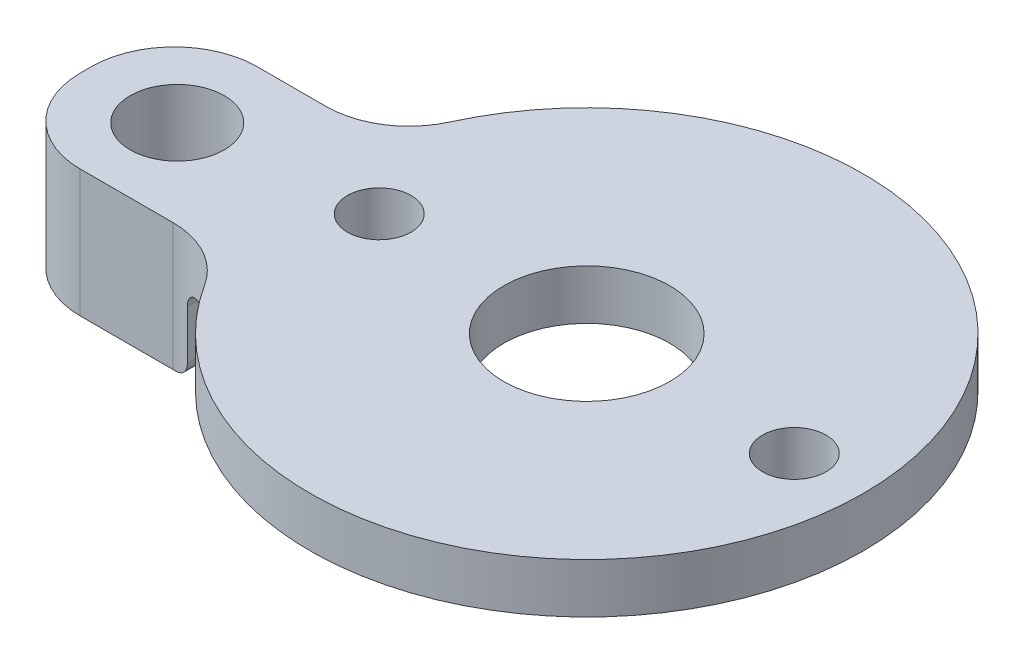
ISO-10303-21;
HEADER;
FILE_DESCRIPTION(('STEP AP214'),'2;1');
FILE_NAME('part.step','',(''),(''),'','','');
FILE_SCHEMA(('AUTOMOTIVE_DESIGN { 1 0 10303 214 1 1 1 1 }'));
ENDSEC;
DATA;
#1=APPLICATION_CONTEXT('core data for automotive mechanical design processes');
#2=APPLICATION_PROTOCOL_DEFINITION('international standard','automotive_design',2000,#1);
#3=PRODUCT_CONTEXT('',#1,'mechanical');
#4=PRODUCT('Part','Part','',(#3));
#5=PRODUCT_RELATED_PRODUCT_CATEGORY('part','',(#4));
#6=PRODUCT_DEFINITION_FORMATION('','',#4);
#7=PRODUCT_DEFINITION_CONTEXT('part definition',#1,'design');
#8=PRODUCT_DEFINITION('design','',#6,#7);
#9=PRODUCT_DEFINITION_SHAPE('','',#8);
#10=(LENGTH_UNIT() NAMED_UNIT(*) SI_UNIT(.MILLI.,.METRE.));
#11=(NAMED_UNIT(*) PLANE_ANGLE_UNIT() SI_UNIT($,.RADIAN.));
#12=(NAMED_UNIT(*) SI_UNIT($,.STERADIAN.) SOLID_ANGLE_UNIT());
#13=UNCERTAINTY_MEASURE_WITH_UNIT(LENGTH_MEASURE(1.E-05),#10,'distance_accuracy_value','');
#14=(GEOMETRIC_REPRESENTATION_CONTEXT(3) GLOBAL_UNCERTAINTY_ASSIGNED_CONTEXT((#13)) GLOBAL_UNIT_ASSIGNED_CONTEXT((#10,
#11,#12)) REPRESENTATION_CONTEXT('',''));
#15=CARTESIAN_POINT('',(0.,0.,0.));
#16=DIRECTION('',(0.,0.,1.));
#17=DIRECTION('',(1.,0.,0.));
#18=AXIS2_PLACEMENT_3D('',#15,#16,#17);
#19=CARTESIAN_POINT('',(0.,0.,0.));
#20=DIRECTION('',(0.,1.,0.));
#21=DIRECTION('',(0.,0.,1.));
#22=AXIS2_PLACEMENT_3D('',#19,#20,#21);
#23=PLANE('',#22);
#24=CARTESIAN_POINT('',(-9.525,0.,0.));
#25=DIRECTION('',(0.,1.,0.));
#26=DIRECTION('',(0.,0.,1.));
#27=AXIS2_PLACEMENT_3D('',#24,#25,#26);
#28=CIRCLE('',#27,1.4605);
#29=CARTESIAN_POINT('',(-9.525,0.,1.4605));
#30=VERTEX_POINT('',#29);
#31=EDGE_CURVE('E287',#30,#30,#28,.T.);
#32=ORIENTED_EDGE('',*,*,#31,.T.);
#33=EDGE_LOOP('',(#32));
#34=FACE_BOUND('',#33,.T.);
#35=CARTESIAN_POINT('',(9.525,0.,0.));
#36=DIRECTION('',(0.,1.,0.));
#37=DIRECTION('',(0.,0.,1.));
#38=AXIS2_PLACEMENT_3D('',#35,#36,#37);
#39=CIRCLE('',#38,1.4605);
#40=CARTESIAN_POINT('',(9.525,0.,1.4605));
#41=VERTEX_POINT('',#40);
#42=EDGE_CURVE('E281',#41,#41,#39,.T.);
#43=ORIENTED_EDGE('',*,*,#42,.T.);
#44=EDGE_LOOP('',(#43));
#45=FACE_BOUND('',#44,.T.);
#46=CARTESIAN_POINT('',(0.,0.,0.));
#47=DIRECTION('',(0.,1.,0.));
#48=DIRECTION('',(0.,0.,1.));
#49=AXIS2_PLACEMENT_3D('',#46,#47,#48);
#50=CIRCLE('',#49,3.81);
#51=CARTESIAN_POINT('',(0.,0.,3.81));
#52=VERTEX_POINT('',#51);
#53=EDGE_CURVE('E274',#52,#52,#50,.T.);
#54=ORIENTED_EDGE('',*,*,#53,.T.);
#55=EDGE_LOOP('',(#54));
#56=FACE_BOUND('',#55,.T.);
#57=CARTESIAN_POINT('',(-13.9121529606312,0.,8.89000000000004));
#58=DIRECTION('',(0.,1.,0.));
#59=DIRECTION('',(0.,0.,1.));
#60=AXIS2_PLACEMENT_3D('',#57,#58,#59);
#61=CIRCLE('',#60,3.81);
#62=CARTESIAN_POINT('',(-10.7016561235625,0.,6.83846153846157));
#63=VERTEX_POINT('',#62);
#64=CARTESIAN_POINT('',(-12.5473847014545,0.,5.33282308582446));
#65=VERTEX_POINT('',#64);
#66=EDGE_CURVE('E205',#63,#65,#61,.T.);
#67=ORIENTED_EDGE('',*,*,#66,.T.);
#68=DIRECTION('',(0.,0.,1.));
#69=VECTOR('',#68,1.);
#70=CARTESIAN_POINT('',(-12.5473847014545,0.,-3.51948445828535));
#71=LINE('',#70,#69);
#72=CARTESIAN_POINT('',(-12.5473847014545,0.,-3.95784349720127));
#73=VERTEX_POINT('',#72);
#74=EDGE_CURVE('E66',#65,#73,#71,.F.);
#75=ORIENTED_EDGE('',*,*,#74,.T.);
#76=CARTESIAN_POINT('',(-15.01825342708,0.,-6.85799999999996));
#77=DIRECTION('',(0.,1.,0.));
#78=DIRECTION('',(0.,0.,1.));
#79=AXIS2_PLACEMENT_3D('',#76,#77,#78);
#80=CIRCLE('',#79,3.81);
#81=CARTESIAN_POINT('',(-11.5525026362154,0.,-5.27538461538458));
#82=VERTEX_POINT('',#81);
#83=EDGE_CURVE('E201',#73,#82,#80,.T.);
#84=ORIENTED_EDGE('',*,*,#83,.T.);
#85=CARTESIAN_POINT('',(0.,0.,0.));
#86=DIRECTION('',(0.,1.,0.));
#87=DIRECTION('',(0.,0.,1.));
#88=AXIS2_PLACEMENT_3D('',#85,#86,#87);
#89=CIRCLE('',#88,12.7);
#90=EDGE_CURVE('E175',#63,#82,#89,.T.);
#91=ORIENTED_EDGE('',*,*,#90,.F.);
#92=EDGE_LOOP('',(#67,#75,#84,#91));
#93=FACE_BOUND('',#92,.T.);
#94=ADVANCED_FACE('F45',(#34,#45,#56,#93),#23,.F.);
#95=CARTESIAN_POINT('',(0.,2.286,0.));
#96=DIRECTION('',(0.,1.,0.));
#97=DIRECTION('',(0.,0.,1.));
#98=AXIS2_PLACEMENT_3D('',#95,#96,#97);
#99=PLANE('',#98);
#100=CARTESIAN_POINT('',(-9.525,2.286,0.));
#101=DIRECTION('',(0.,1.,0.));
#102=DIRECTION('',(0.,0.,1.));
#103=AXIS2_PLACEMENT_3D('',#100,#101,#102);
#104=CIRCLE('',#103,1.4605);
#105=CARTESIAN_POINT('',(-9.525,2.286,1.4605));
#106=VERTEX_POINT('',#105);
#107=EDGE_CURVE('E284',#106,#106,#104,.T.);
#108=ORIENTED_EDGE('',*,*,#107,.F.);
#109=EDGE_LOOP('',(#108));
#110=FACE_BOUND('',#109,.T.);
#111=CARTESIAN_POINT('',(0.,2.286,0.));
#112=DIRECTION('',(0.,1.,0.));
#113=DIRECTION('',(0.,0.,1.));
#114=AXIS2_PLACEMENT_3D('',#111,#112,#113);
#115=CIRCLE('',#114,3.81);
#116=CARTESIAN_POINT('',(0.,2.286,3.81));
#117=VERTEX_POINT('',#116);
#118=EDGE_CURVE('E277',#117,#117,#115,.T.);
#119=ORIENTED_EDGE('',*,*,#118,.F.);
#120=EDGE_LOOP('',(#119));
#121=FACE_BOUND('',#120,.T.);
#122=DIRECTION('',(0.,0.,1.));
#123=VECTOR('',#122,1.);
#124=CARTESIAN_POINT('',(-21.9808156771038,2.286,-3.04799999999995));
#125=LINE('',#124,#123);
#126=CARTESIAN_POINT('',(-21.9808156771038,2.286,0.762000000000044));
#127=VERTEX_POINT('',#126);
#128=CARTESIAN_POINT('',(-21.9808156771038,2.286,1.27000000000004));
#129=VERTEX_POINT('',#128);
#130=EDGE_CURVE('E172',#127,#129,#125,.T.);
#131=ORIENTED_EDGE('',*,*,#130,.T.);
#132=CARTESIAN_POINT('',(-18.1708156771038,2.286,1.27000000000004));
#133=DIRECTION('',(0.,1.,0.));
#134=DIRECTION('',(0.,0.,1.));
#135=AXIS2_PLACEMENT_3D('',#132,#133,#134);
#136=CIRCLE('',#135,3.81);
#137=CARTESIAN_POINT('',(-18.1708156771038,2.286,5.08000000000004));
#138=VERTEX_POINT('',#137);
#139=EDGE_CURVE('E182',#129,#138,#136,.T.);
#140=ORIENTED_EDGE('',*,*,#139,.T.);
#141=DIRECTION('',(1.,0.,0.));
#142=VECTOR('',#141,1.);
#143=CARTESIAN_POINT('',(-21.9808156771038,2.286,5.08000000000004));
#144=LINE('',#143,#142);
#145=CARTESIAN_POINT('',(-13.9121529606312,2.286,5.08000000000004));
#146=VERTEX_POINT('',#145);
#147=EDGE_CURVE('E169',#138,#146,#144,.T.);
#148=ORIENTED_EDGE('',*,*,#147,.T.);
#149=CARTESIAN_POINT('',(-13.9121529606312,2.286,8.89000000000004));
#150=DIRECTION('',(0.,1.,0.));
#151=DIRECTION('',(0.,0.,1.));
#152=AXIS2_PLACEMENT_3D('',#149,#150,#151);
#153=CIRCLE('',#152,3.81);
#154=CARTESIAN_POINT('',(-10.7016561235625,2.286,6.83846153846157));
#155=VERTEX_POINT('',#154);
#156=EDGE_CURVE('E211',#146,#155,#153,.F.);
#157=ORIENTED_EDGE('',*,*,#156,.T.);
#158=CARTESIAN_POINT('',(0.,2.286,0.));
#159=DIRECTION('',(0.,1.,0.));
#160=DIRECTION('',(0.,0.,1.));
#161=AXIS2_PLACEMENT_3D('',#158,#159,#160);
#162=CIRCLE('',#161,12.7);
#163=CARTESIAN_POINT('',(-11.5525026362154,2.286,-5.27538461538458));
#164=VERTEX_POINT('',#163);
#165=EDGE_CURVE('E267',#155,#164,#162,.T.);
#166=ORIENTED_EDGE('',*,*,#165,.T.);
#167=CARTESIAN_POINT('',(-15.01825342708,2.286,-6.85799999999996));
#168=DIRECTION('',(0.,1.,0.));
#169=DIRECTION('',(0.,0.,1.));
#170=AXIS2_PLACEMENT_3D('',#167,#168,#169);
#171=CIRCLE('',#170,3.81);
#172=CARTESIAN_POINT('',(-15.01825342708,2.286,-3.04799999999996));
#173=VERTEX_POINT('',#172);
#174=EDGE_CURVE('E203',#164,#173,#171,.F.);
#175=ORIENTED_EDGE('',*,*,#174,.T.);
#176=DIRECTION('',(-1.,0.,0.));
#177=VECTOR('',#176,1.);
#178=CARTESIAN_POINT('',(-12.3288156771038,2.286,-3.04799999999996));
#179=LINE('',#178,#177);
#180=CARTESIAN_POINT('',(-18.1708156771038,2.286,-3.04799999999996));
#181=VERTEX_POINT('',#180);
#182=EDGE_CURVE('E264',#173,#181,#179,.T.);
#183=ORIENTED_EDGE('',*,*,#182,.T.);
#184=CARTESIAN_POINT('',(-18.1708156771038,2.286,0.762000000000044));
#185=DIRECTION('',(0.,1.,0.));
#186=DIRECTION('',(0.,0.,1.));
#187=AXIS2_PLACEMENT_3D('',#184,#185,#186);
#188=CIRCLE('',#187,3.81);
#189=EDGE_CURVE('E180',#181,#127,#188,.T.);
#190=ORIENTED_EDGE('',*,*,#189,.T.);
#191=EDGE_LOOP('',(#131,#140,#148,#157,#166,#175,#183,#190));
#192=FACE_BOUND('',#191,.T.);
#193=CARTESIAN_POINT('',(9.525,2.286,0.));
#194=DIRECTION('',(0.,1.,0.));
#195=DIRECTION('',(0.,0.,1.));
#196=AXIS2_PLACEMENT_3D('',#193,#194,#195);
#197=CIRCLE('',#196,1.4605);
#198=CARTESIAN_POINT('',(9.525,2.286,1.4605));
#199=VERTEX_POINT('',#198);
#200=EDGE_CURVE('E278',#199,#199,#197,.T.);
#201=ORIENTED_EDGE('',*,*,#200,.F.);
#202=EDGE_LOOP('',(#201));
#203=FACE_BOUND('',#202,.T.);
#204=CARTESIAN_POINT('',(-17.7800000000002,2.286,1.01600000000016));
#205=DIRECTION('',(0.,1.,0.));
#206=DIRECTION('',(0.,0.,1.));
#207=AXIS2_PLACEMENT_3D('',#204,#205,#206);
#208=CIRCLE('',#207,2.159);
#209=CARTESIAN_POINT('',(-17.7800000000002,2.286,3.17500000000017));
#210=VERTEX_POINT('',#209);
#211=EDGE_CURVE('E153',#210,#210,#208,.T.);
#212=ORIENTED_EDGE('',*,*,#211,.F.);
#213=EDGE_LOOP('',(#212));
#214=FACE_BOUND('',#213,.T.);
#215=ADVANCED_FACE('F313',(#110,#121,#192,#203,#214),#99,.T.);
#216=CARTESIAN_POINT('',(0.,2.286,0.));
#217=DIRECTION('',(0.,-1.,0.));
#218=DIRECTION('',(0.,0.,-1.));
#219=AXIS2_PLACEMENT_3D('',#216,#217,#218);
#220=CYLINDRICAL_SURFACE('',#219,12.7);
#221=ORIENTED_EDGE('',*,*,#90,.T.);
#222=DIRECTION('',(0.,-1.,0.));
#223=VECTOR('',#222,1.);
#224=CARTESIAN_POINT('',(-11.5525026362154,2.286,-5.27538461538458));
#225=LINE('',#224,#223);
#226=EDGE_CURVE('E193',#82,#164,#225,.F.);
#227=ORIENTED_EDGE('',*,*,#226,.T.);
#228=ORIENTED_EDGE('',*,*,#165,.F.);
#229=DIRECTION('',(0.,-1.,0.));
#230=VECTOR('',#229,1.);
#231=CARTESIAN_POINT('',(-10.7016561235625,2.286,6.83846153846157));
#232=LINE('',#231,#230);
#233=EDGE_CURVE('E190',#155,#63,#232,.T.);
#234=ORIENTED_EDGE('',*,*,#233,.T.);
#235=EDGE_LOOP('',(#221,#227,#228,#234));
#236=FACE_BOUND('',#235,.T.);
#237=ADVANCED_FACE('F319',(#236),#220,.T.);
#238=CARTESIAN_POINT('',(-12.3288156771038,2.286,-3.04799999999996));
#239=DIRECTION('',(0.,0.,1.));
#240=DIRECTION('',(1.,0.,0.));
#241=AXIS2_PLACEMENT_3D('',#238,#239,#240);
#242=PLANE('',#241);
#243=ORIENTED_EDGE('',*,*,#182,.F.);
#244=DIRECTION('',(0.,1.,0.));
#245=VECTOR('',#244,1.);
#246=CARTESIAN_POINT('',(-15.01825342708,0.,-3.04799999999996));
#247=LINE('',#246,#245);
#248=CARTESIAN_POINT('',(-15.01825342708,-3.556,-3.04799999999996));
#249=VERTEX_POINT('',#248);
#250=EDGE_CURVE('E187',#173,#249,#247,.F.);
#251=ORIENTED_EDGE('',*,*,#250,.T.);
#252=DIRECTION('',(1.,0.,0.));
#253=VECTOR('',#252,1.);
#254=CARTESIAN_POINT('',(-21.9808156771038,-3.556,-3.04799999999996));
#255=LINE('',#254,#253);
#256=CARTESIAN_POINT('',(-18.1708156771038,-3.556,-3.04799999999996));
#257=VERTEX_POINT('',#256);
#258=EDGE_CURVE('E154',#257,#249,#255,.T.);
#259=ORIENTED_EDGE('',*,*,#258,.F.);
#260=DIRECTION('',(0.,-1.,0.));
#261=VECTOR('',#260,1.);
#262=CARTESIAN_POINT('',(-18.1708156771038,2.286,-3.04799999999996));
#263=LINE('',#262,#261);
#264=EDGE_CURVE('E184',#257,#181,#263,.F.);
#265=ORIENTED_EDGE('',*,*,#264,.T.);
#266=EDGE_LOOP('',(#243,#251,#259,#265));
#267=FACE_BOUND('',#266,.T.);
#268=ADVANCED_FACE('F262',(#267),#242,.F.);
#269=CARTESIAN_POINT('',(-21.9808156771038,2.286,-3.04799999999995));
#270=DIRECTION('',(1.,0.,0.));
#271=DIRECTION('',(0.,0.,-1.));
#272=AXIS2_PLACEMENT_3D('',#269,#270,#271);
#273=PLANE('',#272);
#274=DIRECTION('',(0.,0.,-1.));
#275=VECTOR('',#274,1.);
#276=CARTESIAN_POINT('',(-21.9808156771038,-3.556,5.08000000000004));
#277=LINE('',#276,#275);
#278=CARTESIAN_POINT('',(-21.9808156771038,-3.556,1.27000000000004));
#279=VERTEX_POINT('',#278);
#280=CARTESIAN_POINT('',(-21.9808156771038,-3.556,0.762000000000044));
#281=VERTEX_POINT('',#280);
#282=EDGE_CURVE('E295',#279,#281,#277,.T.);
#283=ORIENTED_EDGE('',*,*,#282,.F.);
#284=DIRECTION('',(0.,-1.,0.));
#285=VECTOR('',#284,1.);
#286=CARTESIAN_POINT('',(-21.9808156771038,2.286,1.27000000000004));
#287=LINE('',#286,#285);
#288=EDGE_CURVE('E162',#279,#129,#287,.F.);
#289=ORIENTED_EDGE('',*,*,#288,.T.);
#290=ORIENTED_EDGE('',*,*,#130,.F.);
#291=DIRECTION('',(0.,-1.,0.));
#292=VECTOR('',#291,1.);
#293=CARTESIAN_POINT('',(-21.9808156771038,2.286,0.762000000000044));
#294=LINE('',#293,#292);
#295=EDGE_CURVE('E163',#127,#281,#294,.T.);
#296=ORIENTED_EDGE('',*,*,#295,.T.);
#297=EDGE_LOOP('',(#283,#289,#290,#296));
#298=FACE_BOUND('',#297,.T.);
#299=ADVANCED_FACE('F328',(#298),#273,.F.);
#300=CARTESIAN_POINT('',(-21.9808156771038,2.286,5.08000000000004));
#301=DIRECTION('',(0.,0.,-1.));
#302=DIRECTION('',(-1.,0.,0.));
#303=AXIS2_PLACEMENT_3D('',#300,#301,#302);
#304=PLANE('',#303);
#305=DIRECTION('',(-1.,0.,0.));
#306=VECTOR('',#305,1.);
#307=CARTESIAN_POINT('',(-21.9808156771038,-3.556,5.08000000000004));
#308=LINE('',#307,#306);
#309=CARTESIAN_POINT('',(-13.9121529606312,-3.556,5.08000000000004));
#310=VERTEX_POINT('',#309);
#311=CARTESIAN_POINT('',(-18.1708156771038,-3.556,5.08000000000004));
#312=VERTEX_POINT('',#311);
#313=EDGE_CURVE('E139',#310,#312,#308,.T.);
#314=ORIENTED_EDGE('',*,*,#313,.F.);
#315=DIRECTION('',(0.,1.,0.));
#316=VECTOR('',#315,1.);
#317=CARTESIAN_POINT('',(-13.9121529606312,2.286,5.08000000000004));
#318=LINE('',#317,#316);
#319=EDGE_CURVE('E195',#310,#146,#318,.T.);
#320=ORIENTED_EDGE('',*,*,#319,.T.);
#321=ORIENTED_EDGE('',*,*,#147,.F.);
#322=DIRECTION('',(0.,-1.,0.));
#323=VECTOR('',#322,1.);
#324=CARTESIAN_POINT('',(-18.1708156771038,2.286,5.08000000000004));
#325=LINE('',#324,#323);
#326=EDGE_CURVE('E161',#138,#312,#325,.T.);
#327=ORIENTED_EDGE('',*,*,#326,.T.);
#328=EDGE_LOOP('',(#314,#320,#321,#327));
#329=FACE_BOUND('',#328,.T.);
#330=ADVANCED_FACE('F167',(#329),#304,.F.);
#331=CARTESIAN_POINT('',(0.,2.286,0.));
#332=DIRECTION('',(0.,-1.,0.));
#333=DIRECTION('',(0.,0.,-1.));
#334=AXIS2_PLACEMENT_3D('',#331,#332,#333);
#335=CYLINDRICAL_SURFACE('',#334,3.81);
#336=ORIENTED_EDGE('',*,*,#118,.T.);
#337=EDGE_LOOP('',(#336));
#338=FACE_BOUND('',#337,.T.);
#339=ORIENTED_EDGE('',*,*,#53,.F.);
#340=EDGE_LOOP('',(#339));
#341=FACE_BOUND('',#340,.T.);
#342=ADVANCED_FACE('F327',(#338,#341),#335,.F.);
#343=CARTESIAN_POINT('',(9.525,2.286,0.));
#344=DIRECTION('',(0.,-1.,0.));
#345=DIRECTION('',(0.,0.,-1.));
#346=AXIS2_PLACEMENT_3D('',#343,#344,#345);
#347=CYLINDRICAL_SURFACE('',#346,1.4605);
#348=ORIENTED_EDGE('',*,*,#200,.T.);
#349=EDGE_LOOP('',(#348));
#350=FACE_BOUND('',#349,.T.);
#351=ORIENTED_EDGE('',*,*,#42,.F.);
#352=EDGE_LOOP('',(#351));
#353=FACE_BOUND('',#352,.T.);
#354=ADVANCED_FACE('F405',(#350,#353),#347,.F.);
#355=CARTESIAN_POINT('',(-9.525,2.286,0.));
#356=DIRECTION('',(0.,-1.,0.));
#357=DIRECTION('',(0.,0.,-1.));
#358=AXIS2_PLACEMENT_3D('',#355,#356,#357);
#359=CYLINDRICAL_SURFACE('',#358,1.4605);
#360=ORIENTED_EDGE('',*,*,#107,.T.);
#361=EDGE_LOOP('',(#360));
#362=FACE_BOUND('',#361,.T.);
#363=ORIENTED_EDGE('',*,*,#31,.F.);
#364=EDGE_LOOP('',(#363));
#365=FACE_BOUND('',#364,.T.);
#366=ADVANCED_FACE('F309',(#362,#365),#359,.F.);
#367=CARTESIAN_POINT('',(-17.7800000000002,2.286,1.01600000000016));
#368=DIRECTION('',(0.,-1.,0.));
#369=DIRECTION('',(0.,0.,-1.));
#370=AXIS2_PLACEMENT_3D('',#367,#368,#369);
#371=CYLINDRICAL_SURFACE('',#370,2.159);
#372=ORIENTED_EDGE('',*,*,#211,.T.);
#373=EDGE_LOOP('',(#372));
#374=FACE_BOUND('',#373,.T.);
#375=CARTESIAN_POINT('',(-17.7800000000002,-3.556,1.01600000000016));
#376=DIRECTION('',(0.,-1.,0.));
#377=DIRECTION('',(0.,0.,-1.));
#378=AXIS2_PLACEMENT_3D('',#375,#376,#377);
#379=CIRCLE('',#378,2.159);
#380=CARTESIAN_POINT('',(-17.7800000000002,-3.556,-1.14299999999984));
#381=VERTEX_POINT('',#380);
#382=EDGE_CURVE('E297',#381,#381,#379,.T.);
#383=ORIENTED_EDGE('',*,*,#382,.T.);
#384=EDGE_LOOP('',(#383));
#385=FACE_BOUND('',#384,.T.);
#386=ADVANCED_FACE('F301',(#374,#385),#371,.F.);
#387=CARTESIAN_POINT('',(0.,-3.556,0.));
#388=DIRECTION('',(0.,-1.,0.));
#389=DIRECTION('',(0.,0.,-1.));
#390=AXIS2_PLACEMENT_3D('',#387,#388,#389);
#391=PLANE('',#390);
#392=CARTESIAN_POINT('',(-15.01825342708,-3.556,-6.85799999999996));
#393=DIRECTION('',(0.,-1.,0.));
#394=DIRECTION('',(0.,0.,-1.));
#395=AXIS2_PLACEMENT_3D('',#392,#393,#394);
#396=CIRCLE('',#395,3.81);
#397=CARTESIAN_POINT('',(-13.8173847014545,-3.556,-3.2421993550785));
#398=VERTEX_POINT('',#397);
#399=EDGE_CURVE('E197',#249,#398,#396,.F.);
#400=ORIENTED_EDGE('',*,*,#399,.T.);
#401=DIRECTION('',(0.,0.,1.));
#402=VECTOR('',#401,1.);
#403=CARTESIAN_POINT('',(-13.8173847014545,-3.556,5.15054304906477));
#404=LINE('',#403,#402);
#405=CARTESIAN_POINT('',(-13.8173847014545,-3.556,5.08117879429182));
#406=VERTEX_POINT('',#405);
#407=EDGE_CURVE('E213',#398,#406,#404,.T.);
#408=ORIENTED_EDGE('',*,*,#407,.T.);
#409=CARTESIAN_POINT('',(-13.9121529606312,-3.556,8.89000000000004));
#410=DIRECTION('',(0.,-1.,0.));
#411=DIRECTION('',(0.,0.,-1.));
#412=AXIS2_PLACEMENT_3D('',#409,#410,#411);
#413=CIRCLE('',#412,3.81);
#414=EDGE_CURVE('E149',#406,#310,#413,.F.);
#415=ORIENTED_EDGE('',*,*,#414,.T.);
#416=ORIENTED_EDGE('',*,*,#313,.T.);
#417=CARTESIAN_POINT('',(-18.1708156771038,-3.556,1.27000000000004));
#418=DIRECTION('',(0.,-1.,0.));
#419=DIRECTION('',(0.,0.,-1.));
#420=AXIS2_PLACEMENT_3D('',#417,#418,#419);
#421=CIRCLE('',#420,3.81);
#422=EDGE_CURVE('E145',#312,#279,#421,.T.);
#423=ORIENTED_EDGE('',*,*,#422,.T.);
#424=ORIENTED_EDGE('',*,*,#282,.T.);
#425=CARTESIAN_POINT('',(-18.1708156771038,-3.556,0.762000000000044));
#426=DIRECTION('',(0.,-1.,0.));
#427=DIRECTION('',(0.,0.,-1.));
#428=AXIS2_PLACEMENT_3D('',#425,#426,#427);
#429=CIRCLE('',#428,3.81);
#430=EDGE_CURVE('E164',#281,#257,#429,.T.);
#431=ORIENTED_EDGE('',*,*,#430,.T.);
#432=ORIENTED_EDGE('',*,*,#258,.T.);
#433=EDGE_LOOP('',(#400,#408,#415,#416,#423,#424,#431,#432));
#434=FACE_BOUND('',#433,.T.);
#435=ORIENTED_EDGE('',*,*,#382,.F.);
#436=EDGE_LOOP('',(#435));
#437=FACE_BOUND('',#436,.T.);
#438=ADVANCED_FACE('F142',(#434,#437),#391,.T.);
#439=CARTESIAN_POINT('',(-13.1823847014545,-3.556,5.08000000000004));
#440=DIRECTION('',(-1.,0.,0.));
#441=DIRECTION('',(0.,0.,1.));
#442=AXIS2_PLACEMENT_3D('',#439,#440,#441);
#443=PLANE('',#442);
#444=DIRECTION('',(0.,-1.,0.));
#445=VECTOR('',#444,1.);
#446=CARTESIAN_POINT('',(-13.1823847014545,0.,5.15054304906477));
#447=LINE('',#446,#445);
#448=CARTESIAN_POINT('',(-13.1823847014545,-0.635,5.15054304906477));
#449=VERTEX_POINT('',#448);
#450=CARTESIAN_POINT('',(-13.1823847014545,-2.921,5.15054304906477));
#451=VERTEX_POINT('',#450);
#452=EDGE_CURVE('E207',#449,#451,#447,.T.);
#453=ORIENTED_EDGE('',*,*,#452,.T.);
#454=DIRECTION('',(0.,0.,1.));
#455=VECTOR('',#454,1.);
#456=CARTESIAN_POINT('',(-13.1823847014545,-2.921,-3.51948445828535));
#457=LINE('',#456,#455);
#458=CARTESIAN_POINT('',(-13.1823847014545,-2.921,-3.51948445828535));
#459=VERTEX_POINT('',#458);
#460=EDGE_CURVE('E245',#451,#459,#457,.F.);
#461=ORIENTED_EDGE('',*,*,#460,.T.);
#462=DIRECTION('',(0.,-1.,0.));
#463=VECTOR('',#462,1.);
#464=CARTESIAN_POINT('',(-13.1823847014545,-3.556,-3.51948445828535));
#465=LINE('',#464,#463);
#466=CARTESIAN_POINT('',(-13.1823847014545,-0.635,-3.51948445828535));
#467=VERTEX_POINT('',#466);
#468=EDGE_CURVE('E199',#459,#467,#465,.F.);
#469=ORIENTED_EDGE('',*,*,#468,.T.);
#470=DIRECTION('',(0.,0.,1.));
#471=VECTOR('',#470,1.);
#472=CARTESIAN_POINT('',(-13.1823847014545,-0.635,5.15054304906477));
#473=LINE('',#472,#471);
#474=EDGE_CURVE('E222',#467,#449,#473,.T.);
#475=ORIENTED_EDGE('',*,*,#474,.T.);
#476=EDGE_LOOP('',(#453,#461,#469,#475));
#477=FACE_BOUND('',#476,.T.);
#478=ADVANCED_FACE('F251',(#477),#443,.F.);
#479=CARTESIAN_POINT('',(-18.1708156771038,2.286,1.27000000000004));
#480=DIRECTION('',(0.,-1.,0.));
#481=DIRECTION('',(0.,0.,-1.));
#482=AXIS2_PLACEMENT_3D('',#479,#480,#481);
#483=CYLINDRICAL_SURFACE('',#482,3.81);
#484=ORIENTED_EDGE('',*,*,#139,.F.);
#485=ORIENTED_EDGE('',*,*,#288,.F.);
#486=ORIENTED_EDGE('',*,*,#422,.F.);
#487=ORIENTED_EDGE('',*,*,#326,.F.);
#488=EDGE_LOOP('',(#484,#485,#486,#487));
#489=FACE_BOUND('',#488,.T.);
#490=ADVANCED_FACE('F160',(#489),#483,.T.);
#491=CARTESIAN_POINT('',(-18.1708156771038,2.286,0.762000000000044));
#492=DIRECTION('',(0.,-1.,0.));
#493=DIRECTION('',(0.,0.,-1.));
#494=AXIS2_PLACEMENT_3D('',#491,#492,#493);
#495=CYLINDRICAL_SURFACE('',#494,3.81);
#496=ORIENTED_EDGE('',*,*,#189,.F.);
#497=ORIENTED_EDGE('',*,*,#264,.F.);
#498=ORIENTED_EDGE('',*,*,#430,.F.);
#499=ORIENTED_EDGE('',*,*,#295,.F.);
#500=EDGE_LOOP('',(#496,#497,#498,#499));
#501=FACE_BOUND('',#500,.T.);
#502=ADVANCED_FACE('F338',(#501),#495,.T.);
#503=CARTESIAN_POINT('',(-15.01825342708,2.286,-6.85799999999996));
#504=DIRECTION('',(0.,-1.,0.));
#505=DIRECTION('',(0.,0.,-1.));
#506=AXIS2_PLACEMENT_3D('',#503,#504,#505);
#507=CYLINDRICAL_SURFACE('',#506,3.81);
#508=ORIENTED_EDGE('',*,*,#468,.F.);
#509=CARTESIAN_POINT('',(-13.1823847014545,-2.921,-3.51948445828535));
#510=CARTESIAN_POINT('',(-13.1823439282035,-2.95390367613258,-3.51952091475363));
#511=CARTESIAN_POINT('',(-13.1849390424049,-2.98676338160082,-3.51807970894549));
#512=CARTESIAN_POINT('',(-13.1950607110464,-3.05133171174703,-3.51253656266918));
#513=CARTESIAN_POINT('',(-13.2025640980298,-3.08304500913304,-3.50844712299085));
#514=CARTESIAN_POINT('',(-13.2221564042957,-3.14454758479069,-3.49790315680087));
#515=CARTESIAN_POINT('',(-13.2342400679132,-3.17433902263426,-3.4914513412985));
#516=CARTESIAN_POINT('',(-13.2625090489264,-3.23140722239927,-3.47662192797308));
#517=CARTESIAN_POINT('',(-13.2786984625619,-3.2586814356423,-3.46824240769046));
#518=CARTESIAN_POINT('',(-13.3157369757393,-3.31174757585034,-3.44948239819118));
#519=CARTESIAN_POINT('',(-13.3368070058953,-3.33735302265866,-3.43901215222127));
#520=CARTESIAN_POINT('',(-13.3823733838821,-3.38475876561366,-3.41697726968302));
#521=CARTESIAN_POINT('',(-13.4068711607188,-3.40655746618738,-3.40541217733388));
#522=CARTESIAN_POINT('',(-13.4616182553438,-3.44822484777344,-3.38035874429063));
#523=CARTESIAN_POINT('',(-13.4922042077949,-3.46760960302883,-3.36679952259266));
#524=CARTESIAN_POINT('',(-13.5561587184192,-3.50090157963688,-3.33953601564935));
#525=CARTESIAN_POINT('',(-13.5895270768807,-3.51480919371101,-3.32583174087697));
#526=CARTESIAN_POINT('',(-13.6549330465646,-3.53573173148714,-3.30011259141688));
#527=CARTESIAN_POINT('',(-13.6867854539095,-3.54328465309157,-3.28806284943579));
#528=CARTESIAN_POINT('',(-13.7514923080432,-3.55342289795686,-3.26458558956463));
#529=CARTESIAN_POINT('',(-13.7843467891893,-3.55600805069666,-3.25315809304651));
#530=CARTESIAN_POINT('',(-13.8173847014545,-3.556,-3.2421993550785));
#531=B_SPLINE_CURVE_WITH_KNOTS('',3,(#509,#510,#511,#512,#513,#514,#515,#516,#517,#518,#519,
#520,#521,#522,#523,#524,#525,#526,#527,#528,#529,#530),.UNSPECIFIED.,.F.,.F.,(4,2,2,2,2,2,2,2,
2,2,4),(0.,0.0985081938162232,0.196554743596978,0.294489128209103,0.392521607406547,
0.496422744523141,0.600367327142735,0.715866821286004,0.831358032386763,0.935639334615536,
1.03992421628626),.UNSPECIFIED.);
#532=EDGE_CURVE('E240',#459,#398,#531,.T.);
#533=ORIENTED_EDGE('',*,*,#532,.T.);
#534=ORIENTED_EDGE('',*,*,#399,.F.);
#535=ORIENTED_EDGE('',*,*,#250,.F.);
#536=ORIENTED_EDGE('',*,*,#174,.F.);
#537=ORIENTED_EDGE('',*,*,#226,.F.);
#538=ORIENTED_EDGE('',*,*,#83,.F.);
#539=CARTESIAN_POINT('',(-12.5473847014545,0.,-3.95784349720127));
#540=CARTESIAN_POINT('',(-12.5678260070171,-4.93279088172803E-06,-3.94042706717114));
#541=CARTESIAN_POINT('',(-12.5884450771195,-0.000988280462703028,-3.92323484273261));
#542=CARTESIAN_POINT('',(-12.629948230587,-0.00504291482658046,-3.88936089709017));
#543=CARTESIAN_POINT('',(-12.6508326796288,-0.00811748163344862,-3.872680020965));
#544=CARTESIAN_POINT('',(-12.7138520265109,-0.020711279918371,-3.82342151354368));
#545=CARTESIAN_POINT('',(-12.7561532135029,-0.0336031721453422,-3.79179789209073));
#546=CARTESIAN_POINT('',(-12.8292222061947,-0.0649354403980176,-3.73938434067116));
#547=CARTESIAN_POINT('',(-12.860325529163,-0.0813070414675383,-3.71781383903185));
#548=CARTESIAN_POINT('',(-12.9204710994712,-0.119924194802415,-3.67732146488407));
#549=CARTESIAN_POINT('',(-12.949518252987,-0.142155122674607,-3.65839317509414));
#550=CARTESIAN_POINT('',(-13.0045143286901,-0.19266206987216,-3.62349430374501));
#551=CARTESIAN_POINT('',(-13.0304347815227,-0.220987922657488,-3.60755026289654));
#552=CARTESIAN_POINT('',(-13.0773693479099,-0.283074322917869,-3.5793077634165));
#553=CARTESIAN_POINT('',(-13.0983836440134,-0.316834668106787,-3.56700916914019));
#554=CARTESIAN_POINT('',(-13.131639571093,-0.383843994954973,-3.54784780501018));
#555=CARTESIAN_POINT('',(-13.1446801035353,-0.416553399608844,-3.54047699326047));
#556=CARTESIAN_POINT('',(-13.1652178005094,-0.484173326359068,-3.52896105934845));
#557=CARTESIAN_POINT('',(-13.1727269538386,-0.519078908996001,-3.52480895986897));
#558=CARTESIAN_POINT('',(-13.1789612776424,-0.567777765227982,-3.52136894772309));
#559=CARTESIAN_POINT('',(-13.1802447231302,-0.581190867881978,-3.52066199489911));
#560=CARTESIAN_POINT('',(-13.1819554197095,-0.608066814054902,-3.51972041573359));
#561=CARTESIAN_POINT('',(-13.182384017584,-0.621529545801357,-3.51948504642567));
#562=CARTESIAN_POINT('',(-13.1823847014545,-0.635,-3.51948445828535));
#563=B_SPLINE_CURVE_WITH_KNOTS('',3,(#539,#540,#541,#542,#543,#544,#545,#546,#547,#548,#549,
#550,#551,#552,#553,#554,#555,#556,#557,#558,#559,#560,#561,#562),.UNSPECIFIED.,.F.,.F.,(4,2,2,
2,2,2,2,2,2,2,2,4),(0.,0.0805193602427085,0.16116530868781,0.323234524473865,0.446482206180089,
0.569425138020034,0.693414307651778,0.817398863146499,0.924741931540394,1.03185165275813,
1.07230258434164,1.11268973636655),.UNSPECIFIED.);
#564=EDGE_CURVE('E11',#73,#467,#563,.T.);
#565=ORIENTED_EDGE('',*,*,#564,.T.);
#566=EDGE_LOOP('',(#508,#533,#534,#535,#536,#537,#538,#565));
#567=FACE_BOUND('',#566,.T.);
#568=ADVANCED_FACE('F229',(#567),#507,.F.);
#569=CARTESIAN_POINT('',(-13.9121529606312,2.286,8.89000000000004));
#570=DIRECTION('',(0.,-1.,0.));
#571=DIRECTION('',(0.,0.,-1.));
#572=AXIS2_PLACEMENT_3D('',#569,#570,#571);
#573=CYLINDRICAL_SURFACE('',#572,3.81);
#574=ORIENTED_EDGE('',*,*,#414,.F.);
#575=CARTESIAN_POINT('',(-13.8173847014545,-3.556,5.08117879429183));
#576=CARTESIAN_POINT('',(-13.7818175912241,-3.55603093404726,5.082044913033));
#577=CARTESIAN_POINT('',(-13.746280197767,-3.55301384780142,5.08344589114377));
#578=CARTESIAN_POINT('',(-13.6762940728463,-3.54113361109802,5.08715125479371));
#579=CARTESIAN_POINT('',(-13.6418438773406,-3.53227870769764,5.08945436403627));
#580=CARTESIAN_POINT('',(-13.5749499238582,-3.50896955577937,5.09480149678239));
#581=CARTESIAN_POINT('',(-13.5425065063951,-3.49451436000073,5.0978456455966));
#582=CARTESIAN_POINT('',(-13.4805104653647,-3.46043620626424,5.1044016515553));
#583=CARTESIAN_POINT('',(-13.4509580324598,-3.44081290778162,5.10791353951145));
#584=CARTESIAN_POINT('',(-13.3952621776674,-3.39672227281709,5.11511957838194));
#585=CARTESIAN_POINT('',(-13.3691551837391,-3.37220914662247,5.11881518334278));
#586=CARTESIAN_POINT('',(-13.3214067629804,-3.31912722940016,5.12599904579513));
#587=CARTESIAN_POINT('',(-13.2997661600231,-3.29055769176199,5.12948726494781));
#588=CARTESIAN_POINT('',(-13.2614790992791,-3.23000398134474,5.13592174246276));
#589=CARTESIAN_POINT('',(-13.2448564314507,-3.19800448811121,5.1388653943089));
#590=CARTESIAN_POINT('',(-13.2172509667591,-3.13160583333717,5.14388076100404));
#591=CARTESIAN_POINT('',(-13.2062640428411,-3.09720844880073,5.14595311370419));
#592=CARTESIAN_POINT('',(-13.1929927025324,-3.03899817328074,5.14848461550424));
#593=CARTESIAN_POINT('',(-13.1890188340869,-3.0155700927052,5.14925280373987));
#594=CARTESIAN_POINT('',(-13.1837143284749,-2.96843176137892,5.15028353832765));
#595=CARTESIAN_POINT('',(-13.1823808117643,-2.94472184642622,5.15054663551807));
#596=CARTESIAN_POINT('',(-13.1823847014545,-2.921,5.15054304906477));
#597=B_SPLINE_CURVE_WITH_KNOTS('',3,(#575,#576,#577,#578,#579,#580,#581,#582,#583,#584,#585,
#586,#587,#588,#589,#590,#591,#592,#593,#594,#595,#596),.UNSPECIFIED.,.F.,.F.,(4,2,2,2,2,2,2,2,
2,2,4),(0.,0.106577051880318,0.21300386455286,0.319448686640017,0.425900524100685,
0.53340043071147,0.640920149131603,0.748941888263641,0.856884409745237,0.928065870059262,
0.999169657652726),.UNSPECIFIED.);
#598=EDGE_CURVE('E215',#406,#451,#597,.T.);
#599=ORIENTED_EDGE('',*,*,#598,.T.);
#600=ORIENTED_EDGE('',*,*,#452,.F.);
#601=CARTESIAN_POINT('',(-13.1823847014545,-0.635,5.15054304906477));
#602=CARTESIAN_POINT('',(-13.1824176241769,-0.599890556722269,5.15055072151056));
#603=CARTESIAN_POINT('',(-13.1794748883556,-0.564790812295456,5.15111113814516));
#604=CARTESIAN_POINT('',(-13.1678808656324,-0.495620407336818,5.1533943532516));
#605=CARTESIAN_POINT('',(-13.1592352425782,-0.46154876081836,5.15511599848232));
#606=CARTESIAN_POINT('',(-13.136472148132,-0.395355666227871,5.15977941253084));
#607=CARTESIAN_POINT('',(-13.122352185928,-0.363235113605339,5.16272173679766));
#608=CARTESIAN_POINT('',(-13.0891079503283,-0.301866707944145,5.16992111449849));
#609=CARTESIAN_POINT('',(-13.0699843547536,-0.272618466543204,5.17417798986993));
#610=CARTESIAN_POINT('',(-13.0272941844234,-0.21771786172909,5.18411220621446));
#611=CARTESIAN_POINT('',(-13.0037160504377,-0.192075163370158,5.18979325565113));
#612=CARTESIAN_POINT('',(-12.9529191963876,-0.145140152420208,5.20263567857906));
#613=CARTESIAN_POINT('',(-12.9257003867213,-0.12384794693334,5.20979708850637));
#614=CARTESIAN_POINT('',(-12.8680718577047,-0.0858241380246883,5.22572654246435));
#615=CARTESIAN_POINT('',(-12.8376212702473,-0.0691638371876659,5.23451656512227));
#616=CARTESIAN_POINT('',(-12.77479990514,-0.0411221277147291,5.25357244568901));
#617=CARTESIAN_POINT('',(-12.7424284436891,-0.0297426118252801,5.26383883103356));
#618=CARTESIAN_POINT('',(-12.6828553957996,-0.0140029131521278,5.28365569770397));
#619=CARTESIAN_POINT('',(-12.6558147990141,-0.00872974405104354,5.29298295933641));
#620=CARTESIAN_POINT('',(-12.6016018509469,-0.00172832723326809,5.31237562672101));
#621=CARTESIAN_POINT('',(-12.574429884498,7.18134781057374E-06,5.32243947656807));
#622=CARTESIAN_POINT('',(-12.5473847014545,0.,5.33282308582447));
#623=B_SPLINE_CURVE_WITH_KNOTS('',3,(#601,#602,#603,#604,#605,#606,#607,#608,#609,#610,#611,
#612,#613,#614,#615,#616,#617,#618,#619,#620,#621,#622),.UNSPECIFIED.,.F.,.F.,(4,2,2,2,2,2,2,2,
2,2,4),(0.,0.105186711539975,0.210269113404152,0.315399383745275,0.420515419901939,
0.525908067879528,0.631303310190829,0.738240965930068,0.845216920868902,0.93225396565648,
1.01911219082731),.UNSPECIFIED.);
#624=EDGE_CURVE('E59',#449,#65,#623,.T.);
#625=ORIENTED_EDGE('',*,*,#624,.T.);
#626=ORIENTED_EDGE('',*,*,#66,.F.);
#627=ORIENTED_EDGE('',*,*,#233,.F.);
#628=ORIENTED_EDGE('',*,*,#156,.F.);
#629=ORIENTED_EDGE('',*,*,#319,.F.);
#630=EDGE_LOOP('',(#574,#599,#600,#625,#626,#627,#628,#629));
#631=FACE_BOUND('',#630,.T.);
#632=ADVANCED_FACE('F226',(#631),#573,.F.);
#633=CARTESIAN_POINT('',(-13.8173847014545,-2.921,0.));
#634=DIRECTION('',(0.,0.,-1.));
#635=DIRECTION('',(-1.,0.,0.));
#636=AXIS2_PLACEMENT_3D('',#633,#634,#635);
#637=CYLINDRICAL_SURFACE('',#636,0.635);
#638=ORIENTED_EDGE('',*,*,#532,.F.);
#639=ORIENTED_EDGE('',*,*,#460,.F.);
#640=ORIENTED_EDGE('',*,*,#598,.F.);
#641=ORIENTED_EDGE('',*,*,#407,.F.);
#642=EDGE_LOOP('',(#638,#639,#640,#641));
#643=FACE_BOUND('',#642,.T.);
#644=ADVANCED_FACE('F224',(#643),#637,.T.);
#645=CARTESIAN_POINT('',(-12.5473847014545,-0.635,5.08000000000004));
#646=DIRECTION('',(0.,0.,-1.));
#647=DIRECTION('',(-1.,0.,0.));
#648=AXIS2_PLACEMENT_3D('',#645,#646,#647);
#649=CYLINDRICAL_SURFACE('',#648,0.635);
#650=ORIENTED_EDGE('',*,*,#564,.F.);
#651=ORIENTED_EDGE('',*,*,#74,.F.);
#652=ORIENTED_EDGE('',*,*,#624,.F.);
#653=ORIENTED_EDGE('',*,*,#474,.F.);
#654=EDGE_LOOP('',(#650,#651,#652,#653));
#655=FACE_BOUND('',#654,.T.);
#656=ADVANCED_FACE('F47',(#655),#649,.F.);
#657=CLOSED_SHELL('',(#94,#215,#237,#268,#299,#330,#342,#354,#366,#386,#438,#478,#490,#502,#568,
#632,#644,#656));
#658=MANIFOLD_SOLID_BREP('B2',#657);
#659=ADVANCED_BREP_SHAPE_REPRESENTATION('',(#18,#658),#14);
#660=SHAPE_DEFINITION_REPRESENTATION(#9,#659);
ENDSEC;
END-ISO-10303-21;
